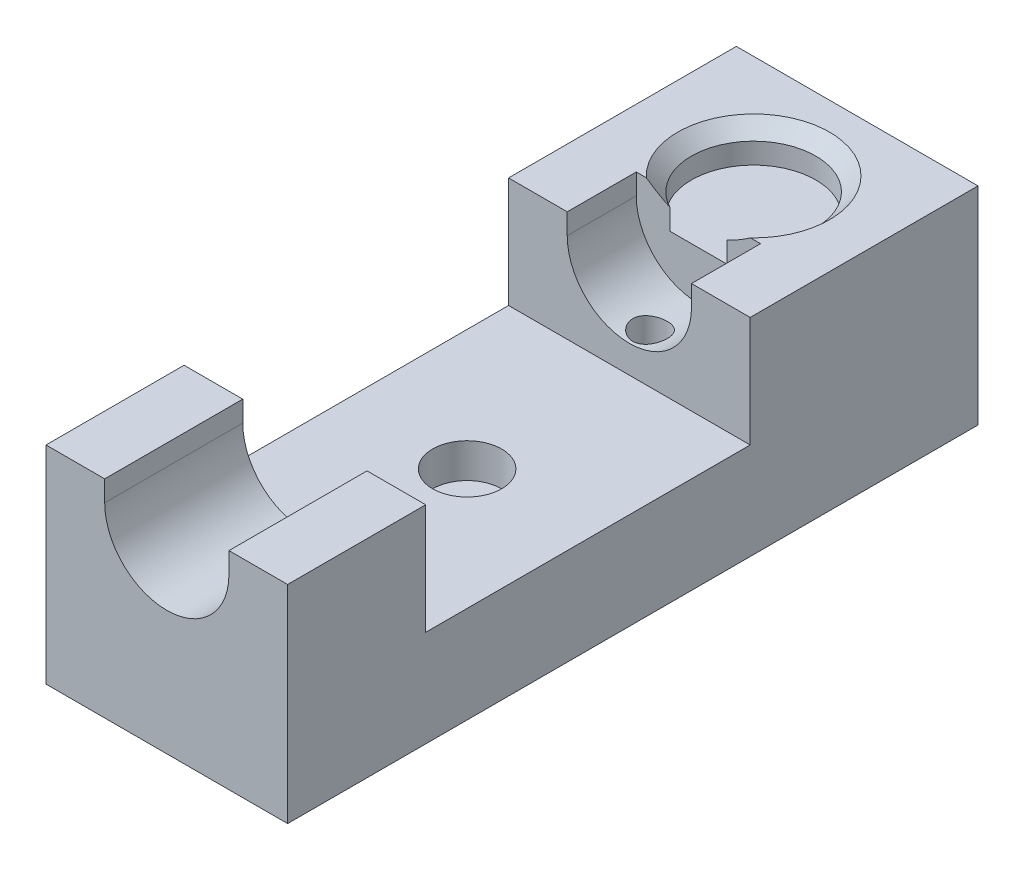
ISO-10303-21;
HEADER;
FILE_DESCRIPTION(('STEP AP214'),'2;1');
FILE_NAME('part.step','',(''),(''),'','','');
FILE_SCHEMA(('AUTOMOTIVE_DESIGN { 1 0 10303 214 1 1 1 1 }'));
ENDSEC;
DATA;
#1=APPLICATION_CONTEXT('core data for automotive mechanical design processes');
#2=APPLICATION_PROTOCOL_DEFINITION('international standard','automotive_design',2000,#1);
#3=PRODUCT_CONTEXT('',#1,'mechanical');
#4=PRODUCT('Part','Part','',(#3));
#5=PRODUCT_RELATED_PRODUCT_CATEGORY('part','',(#4));
#6=PRODUCT_DEFINITION_FORMATION('','',#4);
#7=PRODUCT_DEFINITION_CONTEXT('part definition',#1,'design');
#8=PRODUCT_DEFINITION('design','',#6,#7);
#9=PRODUCT_DEFINITION_SHAPE('','',#8);
#10=(LENGTH_UNIT() NAMED_UNIT(*) SI_UNIT(.MILLI.,.METRE.));
#11=(NAMED_UNIT(*) PLANE_ANGLE_UNIT() SI_UNIT($,.RADIAN.));
#12=(NAMED_UNIT(*) SI_UNIT($,.STERADIAN.) SOLID_ANGLE_UNIT());
#13=UNCERTAINTY_MEASURE_WITH_UNIT(LENGTH_MEASURE(1.E-05),#10,'distance_accuracy_value','');
#14=(GEOMETRIC_REPRESENTATION_CONTEXT(3) GLOBAL_UNCERTAINTY_ASSIGNED_CONTEXT((#13)) GLOBAL_UNIT_ASSIGNED_CONTEXT((#10,
#11,#12)) REPRESENTATION_CONTEXT('',''));
#15=CARTESIAN_POINT('',(0.,0.,0.));
#16=DIRECTION('',(0.,0.,1.));
#17=DIRECTION('',(1.,0.,0.));
#18=AXIS2_PLACEMENT_3D('',#15,#16,#17);
#19=CARTESIAN_POINT('',(0.,30.,0.));
#20=DIRECTION('',(0.,1.,0.));
#21=DIRECTION('',(0.,0.,1.));
#22=AXIS2_PLACEMENT_3D('',#19,#20,#21);
#23=PLANE('',#22);
#24=DIRECTION('',(-1.,0.,0.));
#25=VECTOR('',#24,1.);
#26=CARTESIAN_POINT('',(-17.5,30.,-17.));
#27=LINE('',#26,#25);
#28=CARTESIAN_POINT('',(17.5,30.,-17.));
#29=VERTEX_POINT('',#28);
#30=CARTESIAN_POINT('',(9.00000000000001,30.,-17.));
#31=VERTEX_POINT('',#30);
#32=EDGE_CURVE('E191',#29,#31,#27,.T.);
#33=ORIENTED_EDGE('',*,*,#32,.F.);
#34=DIRECTION('',(0.,0.,-1.));
#35=VECTOR('',#34,1.);
#36=CARTESIAN_POINT('',(17.5,30.,50.));
#37=LINE('',#36,#35);
#38=CARTESIAN_POINT('',(17.5,30.,-50.));
#39=VERTEX_POINT('',#38);
#40=EDGE_CURVE('E259',#29,#39,#37,.T.);
#41=ORIENTED_EDGE('',*,*,#40,.T.);
#42=DIRECTION('',(-1.,0.,0.));
#43=VECTOR('',#42,1.);
#44=CARTESIAN_POINT('',(17.5,30.,-50.));
#45=LINE('',#44,#43);
#46=CARTESIAN_POINT('',(-17.5,30.,-50.));
#47=VERTEX_POINT('',#46);
#48=EDGE_CURVE('E263',#39,#47,#45,.T.);
#49=ORIENTED_EDGE('',*,*,#48,.T.);
#50=DIRECTION('',(0.,0.,1.));
#51=VECTOR('',#50,1.);
#52=CARTESIAN_POINT('',(-17.5,30.,50.));
#53=LINE('',#52,#51);
#54=CARTESIAN_POINT('',(-17.5,30.,-17.));
#55=VERTEX_POINT('',#54);
#56=EDGE_CURVE('E252',#47,#55,#53,.T.);
#57=ORIENTED_EDGE('',*,*,#56,.T.);
#58=CARTESIAN_POINT('',(-9.,30.,-17.));
#59=VERTEX_POINT('',#58);
#60=EDGE_CURVE('E367',#59,#55,#27,.T.);
#61=ORIENTED_EDGE('',*,*,#60,.F.);
#62=DIRECTION('',(0.,0.,1.));
#63=VECTOR('',#62,1.);
#64=CARTESIAN_POINT('',(-9.,30.,0.));
#65=LINE('',#64,#63);
#66=CARTESIAN_POINT('',(-9.,30.,-27.));
#67=VERTEX_POINT('',#66);
#68=EDGE_CURVE('E428',#67,#59,#65,.T.);
#69=ORIENTED_EDGE('',*,*,#68,.F.);
#70=DIRECTION('',(1.,0.,0.));
#71=VECTOR('',#70,1.);
#72=CARTESIAN_POINT('',(0.,30.,-27.));
#73=LINE('',#72,#71);
#74=CARTESIAN_POINT('',(-7.54983443527076,30.,-27.));
#75=VERTEX_POINT('',#74);
#76=EDGE_CURVE('E243',#67,#75,#73,.T.);
#77=ORIENTED_EDGE('',*,*,#76,.T.);
#78=CARTESIAN_POINT('',(0.,30.,-35.));
#79=DIRECTION('',(0.,1.,0.));
#80=DIRECTION('',(0.,0.,1.));
#81=AXIS2_PLACEMENT_3D('',#78,#79,#80);
#82=CIRCLE('',#81,11.);
#83=CARTESIAN_POINT('',(7.54983443527076,30.,-27.));
#84=VERTEX_POINT('',#83);
#85=EDGE_CURVE('E288',#75,#84,#82,.F.);
#86=ORIENTED_EDGE('',*,*,#85,.T.);
#87=CARTESIAN_POINT('',(9.,30.,-27.));
#88=VERTEX_POINT('',#87);
#89=EDGE_CURVE('E65',#84,#88,#73,.T.);
#90=ORIENTED_EDGE('',*,*,#89,.T.);
#91=DIRECTION('',(0.,0.,-1.));
#92=VECTOR('',#91,1.);
#93=CARTESIAN_POINT('',(9.,30.,0.));
#94=LINE('',#93,#92);
#95=EDGE_CURVE('E365',#31,#88,#94,.T.);
#96=ORIENTED_EDGE('',*,*,#95,.F.);
#97=EDGE_LOOP('',(#33,#41,#49,#57,#61,#69,#77,#86,#90,#96));
#98=FACE_BOUND('',#97,.T.);
#99=ADVANCED_FACE('F36',(#98),#23,.T.);
#100=DIRECTION('',(1.,0.,0.));
#101=VECTOR('',#100,1.);
#102=CARTESIAN_POINT('',(-17.5,30.,30.));
#103=LINE('',#102,#101);
#104=CARTESIAN_POINT('',(-17.5,30.,30.));
#105=VERTEX_POINT('',#104);
#106=CARTESIAN_POINT('',(-9.,30.,30.));
#107=VERTEX_POINT('',#106);
#108=EDGE_CURVE('E57',#105,#107,#103,.T.);
#109=ORIENTED_EDGE('',*,*,#108,.F.);
#110=CARTESIAN_POINT('',(-17.5,30.,50.));
#111=VERTEX_POINT('',#110);
#112=EDGE_CURVE('E196',#105,#111,#53,.T.);
#113=ORIENTED_EDGE('',*,*,#112,.T.);
#114=DIRECTION('',(1.,0.,0.));
#115=VECTOR('',#114,1.);
#116=CARTESIAN_POINT('',(17.5,30.,50.));
#117=LINE('',#116,#115);
#118=CARTESIAN_POINT('',(-9.,30.,50.));
#119=VERTEX_POINT('',#118);
#120=EDGE_CURVE('E256',#111,#119,#117,.T.);
#121=ORIENTED_EDGE('',*,*,#120,.T.);
#122=EDGE_CURVE('E427',#107,#119,#65,.T.);
#123=ORIENTED_EDGE('',*,*,#122,.F.);
#124=EDGE_LOOP('',(#109,#113,#121,#123));
#125=FACE_BOUND('',#124,.T.);
#126=ADVANCED_FACE('F336',(#125),#23,.T.);
#127=CARTESIAN_POINT('',(9.,33.,-80.));
#128=DIRECTION('',(1.,0.,0.));
#129=DIRECTION('',(0.,0.,-1.));
#130=AXIS2_PLACEMENT_3D('',#127,#128,#129);
#131=PLANE('',#130);
#132=DIRECTION('',(0.,0.,1.));
#133=VECTOR('',#132,1.);
#134=CARTESIAN_POINT('',(9.,27.,-80.));
#135=LINE('',#134,#133);
#136=CARTESIAN_POINT('',(9.,27.,-27.));
#137=VERTEX_POINT('',#136);
#138=CARTESIAN_POINT('',(9.,27.,-17.));
#139=VERTEX_POINT('',#138);
#140=EDGE_CURVE('E220',#137,#139,#135,.T.);
#141=ORIENTED_EDGE('',*,*,#140,.T.);
#142=DIRECTION('',(0.,1.,0.));
#143=VECTOR('',#142,1.);
#144=CARTESIAN_POINT('',(9.,33.,-17.));
#145=LINE('',#144,#143);
#146=EDGE_CURVE('E213',#139,#31,#145,.T.);
#147=ORIENTED_EDGE('',*,*,#146,.T.);
#148=ORIENTED_EDGE('',*,*,#95,.T.);
#149=DIRECTION('',(0.,-1.,0.));
#150=VECTOR('',#149,1.);
#151=CARTESIAN_POINT('',(9.,33.,-27.));
#152=LINE('',#151,#150);
#153=EDGE_CURVE('E219',#88,#137,#152,.T.);
#154=ORIENTED_EDGE('',*,*,#153,.T.);
#155=EDGE_LOOP('',(#141,#147,#148,#154));
#156=FACE_BOUND('',#155,.T.);
#157=ADVANCED_FACE('F313',(#156),#131,.F.);
#158=CARTESIAN_POINT('',(0.,27.,-80.));
#159=DIRECTION('',(0.,0.,1.));
#160=DIRECTION('',(1.,0.,0.));
#161=AXIS2_PLACEMENT_3D('',#158,#159,#160);
#162=CYLINDRICAL_SURFACE('',#161,9.);
#163=CARTESIAN_POINT('',(0.,18.,-22.5));
#164=CARTESIAN_POINT('',(0.137602501766358,18.0000018396614,-22.4999972008295));
#165=CARTESIAN_POINT('',(0.275234247505333,18.0031865182634,-22.4886013603894));
#166=CARTESIAN_POINT('',(0.546518951988475,18.0155809960352,-22.4434085434694));
#167=CARTESIAN_POINT('',(0.680170207326877,18.0247933370148,-22.4096021165725));
#168=CARTESIAN_POINT('',(0.939539899360599,18.0482286921083,-22.3207825611722));
#169=CARTESIAN_POINT('',(1.06526878019133,18.0624449393814,-22.2657980626032));
#170=CARTESIAN_POINT('',(1.30572139048354,18.0943937483594,-22.1362929873462));
#171=CARTESIAN_POINT('',(1.4204441416246,18.1121266222237,-22.0617706761614));
#172=CARTESIAN_POINT('',(1.63849356943183,18.1496968436527,-21.8933411323144));
#173=CARTESIAN_POINT('',(1.7415062256169,18.1695725275357,-21.7990359206252));
#174=CARTESIAN_POINT('',(1.93047637139271,18.2089478576453,-21.5945674457565));
#175=CARTESIAN_POINT('',(2.01643146169123,18.2284474506237,-21.4844019554483));
#176=CARTESIAN_POINT('',(2.1704161716063,18.2652591141456,-21.2487854797426));
#177=CARTESIAN_POINT('',(2.23807749895612,18.282523041218,-21.1230855831171));
#178=CARTESIAN_POINT('',(2.3511791426234,18.3123419836963,-20.8615361647152));
#179=CARTESIAN_POINT('',(2.39662394672713,18.324897950001,-20.7256886991666));
#180=CARTESIAN_POINT('',(2.46289848736025,18.3434823376449,-20.4511944222944));
#181=CARTESIAN_POINT('',(2.48430073808206,18.3496622817879,-20.3126963567531));
#182=CARTESIAN_POINT('',(2.50366854155515,18.355247014148,-20.0339482289146));
#183=CARTESIAN_POINT('',(2.50163888054625,18.354653185987,-19.8936985302551));
#184=CARTESIAN_POINT('',(2.47465342675359,18.3468926634988,-19.6199554425519));
#185=CARTESIAN_POINT('',(2.45039804541373,18.3399267865017,-19.4863863970069));
#186=CARTESIAN_POINT('',(2.38077462403777,18.3205296590571,-19.2252927428175));
#187=CARTESIAN_POINT('',(2.33540476914306,18.3080979388073,-19.0977686547957));
#188=CARTESIAN_POINT('',(2.22428746268938,18.2789986044504,-18.8505955370892));
#189=CARTESIAN_POINT('',(2.15830043673984,18.2622816279868,-18.7310602663798));
#190=CARTESIAN_POINT('',(2.00798881359268,18.2265209863233,-18.5045168488176));
#191=CARTESIAN_POINT('',(1.92366033258119,18.2074768287162,-18.3975113625477));
#192=CARTESIAN_POINT('',(1.73551122056888,18.1683785574608,-18.1950722391272));
#193=CARTESIAN_POINT('',(1.63110455940471,18.1483125992435,-18.1001847302403));
#194=CARTESIAN_POINT('',(1.40761321440207,18.1100360037841,-17.9291485384444));
#195=CARTESIAN_POINT('',(1.28852785084393,18.091825452531,-17.853000723795));
#196=CARTESIAN_POINT('',(1.03816685867623,18.0591832057447,-17.7213363687399));
#197=CARTESIAN_POINT('',(0.906832791495493,18.0447710270893,-17.6659257921222));
#198=CARTESIAN_POINT('',(0.636219977539428,18.0214901499711,-17.5781318031173));
#199=CARTESIAN_POINT('',(0.49694312824226,18.012620133526,-17.5457429156869));
#200=CARTESIAN_POINT('',(0.219053215426284,18.0016252703318,-17.5057857264421));
#201=CARTESIAN_POINT('',(0.0805546117173627,17.9992989235194,-17.4974757101857));
#202=CARTESIAN_POINT('',(-0.195859861273135,18.0010703941368,-17.5038539965849));
#203=CARTESIAN_POINT('',(-0.33377579456904,18.0051674864365,-17.5185397032961));
#204=CARTESIAN_POINT('',(-0.602413826941716,18.0191946988196,-17.5698866682393));
#205=CARTESIAN_POINT('',(-0.733222576327719,18.0290132566489,-17.606127890115));
#206=CARTESIAN_POINT('',(-0.986886236237452,18.0533634166124,-17.6990637352762));
#207=CARTESIAN_POINT('',(-1.10974024794481,18.0678955502287,-17.7557606651392));
#208=CARTESIAN_POINT('',(-1.34684028081078,18.1005251943186,-17.8893317560929));
#209=CARTESIAN_POINT('',(-1.4608541239069,18.1186905731965,-17.9666010486448));
#210=CARTESIAN_POINT('',(-1.67455534117418,18.156490457428,-18.1386322716154));
#211=CARTESIAN_POINT('',(-1.77423962926342,18.1761252778671,-18.2333979601334));
#212=CARTESIAN_POINT('',(-1.9596240538892,18.2154031463424,-18.4412028877548));
#213=CARTESIAN_POINT('',(-2.04479915770501,18.2350278359544,-18.5547149031079));
#214=CARTESIAN_POINT('',(-2.1949116285828,18.2714061338011,-18.7948412757667));
#215=CARTESIAN_POINT('',(-2.25984976965913,18.2881598518323,-18.9214551317123));
#216=CARTESIAN_POINT('',(-2.36716211667702,18.3167040212995,-19.1836143397486));
#217=CARTESIAN_POINT('',(-2.4096615496651,18.3285219396518,-19.3191052754281));
#218=CARTESIAN_POINT('',(-2.47115304987672,18.3458424635326,-19.5956994187438));
#219=CARTESIAN_POINT('',(-2.49015175812551,18.3513468531573,-19.7368010292315));
#220=CARTESIAN_POINT('',(-2.50369719949209,18.3552592333494,-20.0152115590136));
#221=CARTESIAN_POINT('',(-2.49909142028598,18.353913191859,-20.152476380069));
#222=CARTESIAN_POINT('',(-2.46754286573619,18.3448572602375,-20.4241897876208));
#223=CARTESIAN_POINT('',(-2.44060076098729,18.3371475611601,-20.5586384585411));
#224=CARTESIAN_POINT('',(-2.36565448497556,18.3163856235018,-20.8197344678233));
#225=CARTESIAN_POINT('',(-2.31784429282322,18.3033826616438,-20.9464416852921));
#226=CARTESIAN_POINT('',(-2.2026690334138,18.2735016790497,-21.1901348450181));
#227=CARTESIAN_POINT('',(-2.13530066717351,18.2566230046766,-21.3071191429723));
#228=CARTESIAN_POINT('',(-1.98041392404218,18.220223784267,-21.5320553056494));
#229=CARTESIAN_POINT('',(-1.89232416869259,18.2006364203479,-21.6396029533652));
#230=CARTESIAN_POINT('',(-1.69956305490125,18.1613833618196,-21.8386647441072));
#231=CARTESIAN_POINT('',(-1.59488759125636,18.1417176489956,-21.930174905782));
#232=CARTESIAN_POINT('',(-1.36892046461578,18.1039632083671,-22.0967162731561));
#233=CARTESIAN_POINT('',(-1.24729251786435,18.0859231761437,-22.1713032466213));
#234=CARTESIAN_POINT('',(-0.992723965385674,18.0540005019884,-22.298856278579));
#235=CARTESIAN_POINT('',(-0.859790060353445,18.0401154192934,-22.351835037162));
#236=CARTESIAN_POINT('',(-0.606290967533398,18.0196785033609,-22.4284401614694));
#237=CARTESIAN_POINT('',(-0.48672880433748,18.0123550867629,-22.4552095751857));
#238=CARTESIAN_POINT('',(-0.244785251386816,18.0025153004743,-22.4909896916451));
#239=CARTESIAN_POINT('',(-0.12240419603883,17.9999983635306,-22.5000024899998));
#240=CARTESIAN_POINT('',(0.,18.,-22.5));
#241=B_SPLINE_CURVE_WITH_KNOTS('',3,(#163,#164,#165,#166,#167,#168,#169,#170,#171,#172,#173,
#174,#175,#176,#177,#178,#179,#180,#181,#182,#183,#184,#185,#186,#187,#188,#189,#190,#191,#192,
#193,#194,#195,#196,#197,#198,#199,#200,#201,#202,#203,#204,#205,#206,#207,#208,#209,#210,#211,
#212,#213,#214,#215,#216,#217,#218,#219,#220,#221,#222,#223,#224,#225,#226,#227,#228,#229,#230,
#231,#232,#233,#234,#235,#236,#237,#238,#239,#240),.UNSPECIFIED.,.T.,.F.,(4,2,2,2,2,2,2,2,2,2,2,
2,2,2,2,2,2,2,2,2,2,2,2,2,2,2,2,2,2,2,2,2,2,2,2,2,2,2,4),(0.,0.41235838619898,0.824890772294518,
1.2368674158857,1.64888064567586,2.07015248650528,2.4914835408799,2.92075380647343,
3.34993732266767,3.76866863882697,4.18731442577044,4.59320465989599,4.99912978807062,
5.40995920090066,5.82087569194105,6.24638987685078,6.67192377325046,7.09960331280653,
7.52718110708768,7.94144021185607,8.35565255505709,8.76204634963727,9.16848598334831,
9.58337897777206,9.99836119210681,10.4261198341446,10.8538621134515,11.279191297197,
11.7044002604958,12.1144519850639,12.5244913992549,12.9307978713244,13.3371729171665,
13.7564382656793,14.1758075510163,14.6051618118986,15.0342633576383,15.4011197307045,
15.7679328052826),.UNSPECIFIED.);
#242=CARTESIAN_POINT('',(0.,18.,-22.5));
#243=VERTEX_POINT('',#242);
#244=EDGE_CURVE('E41',#243,#243,#241,.T.);
#245=ORIENTED_EDGE('',*,*,#244,.T.);
#246=EDGE_LOOP('',(#245));
#247=FACE_BOUND('',#246,.T.);
#248=DIRECTION('',(0.,0.,1.));
#249=VECTOR('',#248,1.);
#250=CARTESIAN_POINT('',(-9.,27.,-80.));
#251=LINE('',#250,#249);
#252=CARTESIAN_POINT('',(-9.,27.,-27.));
#253=VERTEX_POINT('',#252);
#254=CARTESIAN_POINT('',(-9.,27.,-17.));
#255=VERTEX_POINT('',#254);
#256=EDGE_CURVE('E234',#253,#255,#251,.T.);
#257=ORIENTED_EDGE('',*,*,#256,.T.);
#258=CARTESIAN_POINT('',(0.,27.,-17.));
#259=DIRECTION('',(0.,0.,-1.));
#260=DIRECTION('',(-1.,0.,0.));
#261=AXIS2_PLACEMENT_3D('',#258,#259,#260);
#262=CIRCLE('',#261,9.);
#263=EDGE_CURVE('E210',#255,#139,#262,.F.);
#264=ORIENTED_EDGE('',*,*,#263,.T.);
#265=ORIENTED_EDGE('',*,*,#140,.F.);
#266=CARTESIAN_POINT('',(0.,27.,-27.));
#267=DIRECTION('',(0.,0.,1.));
#268=DIRECTION('',(1.,0.,0.));
#269=AXIS2_PLACEMENT_3D('',#266,#267,#268);
#270=CIRCLE('',#269,9.);
#271=EDGE_CURVE('E217',#137,#253,#270,.F.);
#272=ORIENTED_EDGE('',*,*,#271,.T.);
#273=EDGE_LOOP('',(#257,#264,#265,#272));
#274=FACE_BOUND('',#273,.T.);
#275=ADVANCED_FACE('F318',(#247,#274),#162,.F.);
#276=CARTESIAN_POINT('',(-9.,33.,-80.));
#277=DIRECTION('',(-1.,0.,0.));
#278=DIRECTION('',(0.,0.,1.));
#279=AXIS2_PLACEMENT_3D('',#276,#277,#278);
#280=PLANE('',#279);
#281=ORIENTED_EDGE('',*,*,#68,.T.);
#282=DIRECTION('',(0.,-1.,0.));
#283=VECTOR('',#282,1.);
#284=CARTESIAN_POINT('',(-9.,33.,-17.));
#285=LINE('',#284,#283);
#286=EDGE_CURVE('E12',#59,#255,#285,.T.);
#287=ORIENTED_EDGE('',*,*,#286,.T.);
#288=ORIENTED_EDGE('',*,*,#256,.F.);
#289=DIRECTION('',(0.,1.,0.));
#290=VECTOR('',#289,1.);
#291=CARTESIAN_POINT('',(-9.,33.,-27.));
#292=LINE('',#291,#290);
#293=EDGE_CURVE('E222',#253,#67,#292,.T.);
#294=ORIENTED_EDGE('',*,*,#293,.T.);
#295=EDGE_LOOP('',(#281,#287,#288,#294));
#296=FACE_BOUND('',#295,.T.);
#297=ADVANCED_FACE('F322',(#296),#280,.F.);
#298=CARTESIAN_POINT('',(0.,25.,-35.));
#299=DIRECTION('',(0.,1.,0.));
#300=DIRECTION('',(0.,0.,1.));
#301=AXIS2_PLACEMENT_3D('',#298,#299,#300);
#302=CYLINDRICAL_SURFACE('',#301,9.);
#303=DIRECTION('',(0.,1.,0.));
#304=VECTOR('',#303,1.);
#305=CARTESIAN_POINT('',(4.12310562561765,25.,-27.));
#306=LINE('',#305,#304);
#307=CARTESIAN_POINT('',(4.12310562561765,28.,-27.));
#308=VERTEX_POINT('',#307);
#309=CARTESIAN_POINT('',(4.12310562561765,25.,-27.));
#310=VERTEX_POINT('',#309);
#311=EDGE_CURVE('E239',#308,#310,#306,.F.);
#312=ORIENTED_EDGE('',*,*,#311,.F.);
#313=CARTESIAN_POINT('',(0.,28.,-35.));
#314=DIRECTION('',(0.,1.,0.));
#315=DIRECTION('',(0.,0.,1.));
#316=AXIS2_PLACEMENT_3D('',#313,#314,#315);
#317=CIRCLE('',#316,9.);
#318=CARTESIAN_POINT('',(-4.12310562561764,28.,-27.));
#319=VERTEX_POINT('',#318);
#320=EDGE_CURVE('E285',#308,#319,#317,.T.);
#321=ORIENTED_EDGE('',*,*,#320,.T.);
#322=DIRECTION('',(0.,1.,0.));
#323=VECTOR('',#322,1.);
#324=CARTESIAN_POINT('',(-4.12310562561764,25.,-27.));
#325=LINE('',#324,#323);
#326=CARTESIAN_POINT('',(-4.12310562561764,25.,-27.));
#327=VERTEX_POINT('',#326);
#328=EDGE_CURVE('E246',#327,#319,#325,.T.);
#329=ORIENTED_EDGE('',*,*,#328,.F.);
#330=CARTESIAN_POINT('',(0.,25.,-35.));
#331=DIRECTION('',(0.,1.,0.));
#332=DIRECTION('',(0.,0.,1.));
#333=AXIS2_PLACEMENT_3D('',#330,#331,#332);
#334=CIRCLE('',#333,9.);
#335=EDGE_CURVE('E248',#310,#327,#334,.T.);
#336=ORIENTED_EDGE('',*,*,#335,.F.);
#337=EDGE_LOOP('',(#312,#321,#329,#336));
#338=FACE_BOUND('',#337,.T.);
#339=ADVANCED_FACE('F326',(#338),#302,.F.);
#340=CARTESIAN_POINT('',(0.,25.,-35.));
#341=DIRECTION('',(0.,1.,0.));
#342=DIRECTION('',(0.,0.,1.));
#343=AXIS2_PLACEMENT_3D('',#340,#341,#342);
#344=PLANE('',#343);
#345=ORIENTED_EDGE('',*,*,#335,.T.);
#346=DIRECTION('',(1.,0.,0.));
#347=VECTOR('',#346,1.);
#348=CARTESIAN_POINT('',(0.,25.,-27.));
#349=LINE('',#348,#347);
#350=EDGE_CURVE('E242',#327,#310,#349,.T.);
#351=ORIENTED_EDGE('',*,*,#350,.T.);
#352=EDGE_LOOP('',(#345,#351));
#353=FACE_BOUND('',#352,.T.);
#354=ADVANCED_FACE('F323',(#353),#344,.T.);
#355=CARTESIAN_POINT('',(0.,28.,-35.));
#356=DIRECTION('',(0.,1.,0.));
#357=DIRECTION('',(0.,0.,1.));
#358=AXIS2_PLACEMENT_3D('',#355,#356,#357);
#359=CONICAL_SURFACE('',#358,9.,0.785398163397451);
#360=ORIENTED_EDGE('',*,*,#85,.F.);
#361=CARTESIAN_POINT('',(-19.8666621657649,40.4169154083549,-27.));
#362=CARTESIAN_POINT('',(-19.5670431805727,40.1389918048468,-27.));
#363=CARTESIAN_POINT('',(-19.2669938004324,39.8615313307034,-27.));
#364=CARTESIAN_POINT('',(-18.6659002527451,39.3076859468649,-27.));
#365=CARTESIAN_POINT('',(-18.3648560781792,39.031301044789,-27.));
#366=CARTESIAN_POINT('',(-17.7615772989688,38.4796998100724,-27.));
#367=CARTESIAN_POINT('',(-17.4593424486667,38.2044837458635,-27.));
#368=CARTESIAN_POINT('',(-16.8535816584682,37.6554787578372,-27.));
#369=CARTESIAN_POINT('',(-16.5500557210161,37.3816898313201,-27.));
#370=CARTESIAN_POINT('',(-15.633583861047,36.5594796740582,-27.));
#371=CARTESIAN_POINT('',(-15.0183866200404,36.01355499078,-27.));
#372=CARTESIAN_POINT('',(-14.0895560008401,35.2016415507465,-27.));
#373=CARTESIAN_POINT('',(-13.7789566666907,34.9321801351757,-27.));
#374=CARTESIAN_POINT('',(-13.1553620762469,34.3960423829714,-27.));
#375=CARTESIAN_POINT('',(-12.8423668310399,34.1293660334631,-27.));
#376=CARTESIAN_POINT('',(-12.2770405963839,33.6529013025091,-27.));
#377=CARTESIAN_POINT('',(-12.0252250435898,33.4425015897792,-27.));
#378=CARTESIAN_POINT('',(-11.5195086995499,33.024224372918,-27.));
#379=CARTESIAN_POINT('',(-11.2656079245874,32.8163468491225,-27.));
#380=CARTESIAN_POINT('',(-10.7553207061515,32.4035226903952,-27.));
#381=CARTESIAN_POINT('',(-10.4989336239268,32.1985768440045,-27.));
#382=CARTESIAN_POINT('',(-9.98334111050169,31.7922595853298,-27.));
#383=CARTESIAN_POINT('',(-9.72413570074207,31.5908881458835,-27.));
#384=CARTESIAN_POINT('',(-9.20273681591375,31.1927052829389,-27.));
#385=CARTESIAN_POINT('',(-8.94054734830518,30.9958886226879,-27.));
#386=CARTESIAN_POINT('',(-8.41227708683221,30.6075118923883,-27.));
#387=CARTESIAN_POINT('',(-8.14619613736109,30.4159520334266,-27.));
#388=CARTESIAN_POINT('',(-7.60956501272711,30.0394261514339,-27.));
#389=CARTESIAN_POINT('',(-7.33901681467567,29.8544573200634,-27.));
#390=CARTESIAN_POINT('',(-6.792531359551,29.4926889481935,-27.));
#391=CARTESIAN_POINT('',(-6.5165947236771,29.3158884738333,-27.));
#392=CARTESIAN_POINT('',(-5.96926851045465,28.9793500494816,-27.));
#393=CARTESIAN_POINT('',(-5.69812439589338,28.8192149849589,-27.));
#394=CARTESIAN_POINT('',(-5.14895094637564,28.5110473897559,-27.));
#395=CARTESIAN_POINT('',(-4.87092084914534,28.36301620684,-27.));
#396=CARTESIAN_POINT('',(-4.30722807174604,28.0825365797291,-27.));
#397=CARTESIAN_POINT('',(-4.02156962555449,27.9500797031615,-27.));
#398=CARTESIAN_POINT('',(-3.4418174135611,27.7050086864469,-27.));
#399=CARTESIAN_POINT('',(-3.14772600169208,27.5923890705363,-27.));
#400=CARTESIAN_POINT('',(-2.61604920010849,27.4140019794291,-27.));
#401=CARTESIAN_POINT('',(-2.38010467001172,27.3433723376713,-27.));
#402=CARTESIAN_POINT('',(-1.9035200546437,27.2201249008248,-27.));
#403=CARTESIAN_POINT('',(-1.66288055043966,27.1675048915583,-27.));
#404=CARTESIAN_POINT('',(-1.17878115599915,27.0828809592266,-27.));
#405=CARTESIAN_POINT('',(-0.935333393689107,27.0508086585682,-27.));
#406=CARTESIAN_POINT('',(-0.44651999810978,27.0087529416456,-27.));
#407=CARTESIAN_POINT('',(-0.201154482819247,26.9987681771404,-27.));
#408=CARTESIAN_POINT('',(0.290193231333585,27.0014795504052,-27.));
#409=CARTESIAN_POINT('',(0.536175046229777,27.0142444988249,-27.));
#410=CARTESIAN_POINT('',(1.02597796554054,27.0618346881289,-27.));
#411=CARTESIAN_POINT('',(1.2697988998105,27.0966616507684,-27.));
#412=CARTESIAN_POINT('',(1.75439764187019,27.186635431302,-27.));
#413=CARTESIAN_POINT('',(1.99516350407844,27.2418456494544,-27.));
#414=CARTESIAN_POINT('',(2.47186691237024,27.3700284389632,-27.));
#415=CARTESIAN_POINT('',(2.7078042110371,27.4430019180549,-27.));
#416=CARTESIAN_POINT('',(3.1984597169047,27.6123033680078,-27.));
#417=CARTESIAN_POINT('',(3.45261020595399,27.7102624226325,-27.));
#418=CARTESIAN_POINT('',(3.95466251121506,27.9211779347405,-27.));
#419=CARTESIAN_POINT('',(4.20256166312908,28.0341406623654,-27.));
#420=CARTESIAN_POINT('',(4.69283623573977,28.2723637458414,-27.));
#421=CARTESIAN_POINT('',(4.93520193505558,28.3976439579074,-27.));
#422=CARTESIAN_POINT('',(5.41454501750225,28.6579920057031,-27.));
#423=CARTESIAN_POINT('',(5.65152306791171,28.7930586205818,-27.));
#424=CARTESIAN_POINT('',(6.12372072991422,29.072901232722,-27.));
#425=CARTESIAN_POINT('',(6.35887999168321,29.2177785889015,-27.));
#426=CARTESIAN_POINT('',(6.82496694550957,29.5141730814552,-27.));
#427=CARTESIAN_POINT('',(7.05589454248618,29.6656903667623,-27.));
#428=CARTESIAN_POINT('',(7.51384783909042,29.9740275824977,-27.));
#429=CARTESIAN_POINT('',(7.74087708360052,30.130842263522,-27.));
#430=CARTESIAN_POINT('',(8.1917427518241,30.4489800302676,-27.));
#431=CARTESIAN_POINT('',(8.41557920977764,30.6103030675855,-27.));
#432=CARTESIAN_POINT('',(8.89424390990901,30.9614903866272,-27.));
#433=CARTESIAN_POINT('',(9.14861978054808,31.1519703726578,-27.));
#434=CARTESIAN_POINT('',(9.65424126412794,31.5370470939244,-27.));
#435=CARTESIAN_POINT('',(9.90548677933582,31.7316439571844,-27.));
#436=CARTESIAN_POINT('',(10.4053160511475,32.1242782197103,-27.));
#437=CARTESIAN_POINT('',(10.6538995106073,32.3223159967192,-27.));
#438=CARTESIAN_POINT('',(11.1487488821807,32.7212687682572,-27.));
#439=CARTESIAN_POINT('',(11.3950147612377,32.9221838037229,-27.));
#440=CARTESIAN_POINT('',(12.1312670442653,33.5289371145042,-27.));
#441=CARTESIAN_POINT('',(12.6182497594,33.9384208521475,-27.));
#442=CARTESIAN_POINT('',(13.5861360539167,34.7645079307232,-27.));
#443=CARTESIAN_POINT('',(14.0670394624946,35.1811114709236,-27.));
#444=CARTESIAN_POINT('',(14.9958931231605,35.9949922736025,-27.));
#445=CARTESIAN_POINT('',(15.4441144296445,36.3919606466664,-27.));
#446=CARTESIAN_POINT('',(16.3372033379023,37.1896660592251,-27.));
#447=CARTESIAN_POINT('',(16.7820708692518,37.590403177463,-27.));
#448=CARTESIAN_POINT('',(17.6681756708102,38.394060579238,-27.));
#449=CARTESIAN_POINT('',(18.1094184912181,38.796974750181,-27.));
#450=CARTESIAN_POINT('',(18.9896278108283,39.6052434618337,-27.));
#451=CARTESIAN_POINT('',(19.4285944109869,40.0105978925581,-27.));
#452=CARTESIAN_POINT('',(19.8666621657649,40.416915408355,-27.));
#453=B_SPLINE_CURVE_WITH_KNOTS('',3,(#361,#362,#363,#364,#365,#366,#367,#368,#369,#370,#371,
#372,#373,#374,#375,#376,#377,#378,#379,#380,#381,#382,#383,#384,#385,#386,#387,#388,#389,#390,
#391,#392,#393,#394,#395,#396,#397,#398,#399,#400,#401,#402,#403,#404,#405,#406,#407,#408,#409,
#410,#411,#412,#413,#414,#415,#416,#417,#418,#419,#420,#421,#422,#423,#424,#425,#426,#427,#428,
#429,#430,#431,#432,#433,#434,#435,#436,#437,#438,#439,#440,#441,#442,#443,#444,#445,#446,#447,
#448,#449,#450,#451,#452),.UNSPECIFIED.,.F.,.F.,(4,2,2,2,2,2,2,2,2,2,2,2,2,2,2,2,2,2,2,2,2,2,2,
2,2,2,2,2,2,2,2,2,2,2,2,2,2,2,2,2,2,2,2,2,2,4),(0.,1.22601725628922,2.45204318151986,
3.67833690205008,4.90462830192381,7.37203693962777,8.60561016410531,9.83917768351192,
10.8235991021969,11.8080128409482,12.7926865614829,13.7773527962182,14.760824208823,
15.7443350551098,16.7274217051952,17.7103956827294,18.6548547926038,19.5994189249653,
20.5434692652414,21.4872586055109,22.225528807182,22.9637082102662,23.69941820102,
24.4350832822055,25.1729772942272,25.9109288997821,26.6511954447139,27.3914998265768,
28.2080330372563,29.0249085629936,29.8431232118293,30.661235963767,31.4897172155327,
32.3182170595747,33.1459186962834,33.9736114498771,34.9269257289532,35.8802696972673,
36.8337189931753,37.7871818679344,39.6958607988876,41.6045932374327,43.4007781310891,
45.1970006374208,46.9895629769017,48.7820451195556),.UNSPECIFIED.);
#454=EDGE_CURVE('E297',#75,#319,#453,.T.);
#455=ORIENTED_EDGE('',*,*,#454,.T.);
#456=ORIENTED_EDGE('',*,*,#320,.F.);
#457=EDGE_CURVE('E291',#308,#84,#453,.T.);
#458=ORIENTED_EDGE('',*,*,#457,.T.);
#459=EDGE_LOOP('',(#360,#455,#456,#458));
#460=FACE_BOUND('',#459,.T.);
#461=ADVANCED_FACE('F38',(#460),#359,.F.);
#462=CARTESIAN_POINT('',(-17.5,30.,50.));
#463=DIRECTION('',(1.,0.,0.));
#464=DIRECTION('',(0.,0.,-1.));
#465=AXIS2_PLACEMENT_3D('',#462,#463,#464);
#466=PLANE('',#465);
#467=DIRECTION('',(0.,0.,1.));
#468=VECTOR('',#467,1.);
#469=CARTESIAN_POINT('',(-17.5,14.,-17.));
#470=LINE('',#469,#468);
#471=CARTESIAN_POINT('',(-17.5,14.,-17.));
#472=VERTEX_POINT('',#471);
#473=CARTESIAN_POINT('',(-17.5,14.,30.));
#474=VERTEX_POINT('',#473);
#475=EDGE_CURVE('E182',#472,#474,#470,.T.);
#476=ORIENTED_EDGE('',*,*,#475,.F.);
#477=DIRECTION('',(0.,1.,0.));
#478=VECTOR('',#477,1.);
#479=CARTESIAN_POINT('',(-17.5,14.,-17.));
#480=LINE('',#479,#478);
#481=EDGE_CURVE('E207',#472,#55,#480,.T.);
#482=ORIENTED_EDGE('',*,*,#481,.T.);
#483=ORIENTED_EDGE('',*,*,#56,.F.);
#484=DIRECTION('',(0.,-1.,0.));
#485=VECTOR('',#484,1.);
#486=CARTESIAN_POINT('',(-17.5,30.,-50.));
#487=LINE('',#486,#485);
#488=CARTESIAN_POINT('',(-17.5,0.,-50.));
#489=VERTEX_POINT('',#488);
#490=EDGE_CURVE('E265',#47,#489,#487,.T.);
#491=ORIENTED_EDGE('',*,*,#490,.T.);
#492=DIRECTION('',(0.,0.,1.));
#493=VECTOR('',#492,1.);
#494=CARTESIAN_POINT('',(-17.5,0.,50.));
#495=LINE('',#494,#493);
#496=CARTESIAN_POINT('',(-17.5,0.,50.));
#497=VERTEX_POINT('',#496);
#498=EDGE_CURVE('E251',#489,#497,#495,.T.);
#499=ORIENTED_EDGE('',*,*,#498,.T.);
#500=DIRECTION('',(0.,-1.,0.));
#501=VECTOR('',#500,1.);
#502=CARTESIAN_POINT('',(-17.5,30.,50.));
#503=LINE('',#502,#501);
#504=EDGE_CURVE('E282',#111,#497,#503,.T.);
#505=ORIENTED_EDGE('',*,*,#504,.F.);
#506=ORIENTED_EDGE('',*,*,#112,.F.);
#507=DIRECTION('',(0.,1.,0.));
#508=VECTOR('',#507,1.);
#509=CARTESIAN_POINT('',(-17.5,14.,30.));
#510=LINE('',#509,#508);
#511=EDGE_CURVE('E176',#474,#105,#510,.T.);
#512=ORIENTED_EDGE('',*,*,#511,.F.);
#513=EDGE_LOOP('',(#476,#482,#483,#491,#499,#505,#506,#512));
#514=FACE_BOUND('',#513,.T.);
#515=ADVANCED_FACE('F194',(#514),#466,.F.);
#516=CARTESIAN_POINT('',(17.5,30.,50.));
#517=DIRECTION('',(0.,0.,-1.));
#518=DIRECTION('',(-1.,0.,0.));
#519=AXIS2_PLACEMENT_3D('',#516,#517,#518);
#520=PLANE('',#519);
#521=CARTESIAN_POINT('',(9.,30.,50.));
#522=VERTEX_POINT('',#521);
#523=CARTESIAN_POINT('',(17.5,30.,50.));
#524=VERTEX_POINT('',#523);
#525=EDGE_CURVE('E255',#522,#524,#117,.T.);
#526=ORIENTED_EDGE('',*,*,#525,.F.);
#527=DIRECTION('',(0.,1.,0.));
#528=VECTOR('',#527,1.);
#529=CARTESIAN_POINT('',(9.,33.,50.));
#530=LINE('',#529,#528);
#531=CARTESIAN_POINT('',(9.,27.,50.));
#532=VERTEX_POINT('',#531);
#533=EDGE_CURVE('E228',#532,#522,#530,.T.);
#534=ORIENTED_EDGE('',*,*,#533,.F.);
#535=CARTESIAN_POINT('',(0.,27.,50.));
#536=DIRECTION('',(0.,0.,1.));
#537=DIRECTION('',(1.,0.,0.));
#538=AXIS2_PLACEMENT_3D('',#535,#536,#537);
#539=CIRCLE('',#538,9.);
#540=CARTESIAN_POINT('',(-9.,27.,50.));
#541=VERTEX_POINT('',#540);
#542=EDGE_CURVE('E225',#541,#532,#539,.T.);
#543=ORIENTED_EDGE('',*,*,#542,.F.);
#544=DIRECTION('',(0.,-1.,0.));
#545=VECTOR('',#544,1.);
#546=CARTESIAN_POINT('',(-9.,33.,50.));
#547=LINE('',#546,#545);
#548=EDGE_CURVE('E216',#119,#541,#547,.T.);
#549=ORIENTED_EDGE('',*,*,#548,.F.);
#550=ORIENTED_EDGE('',*,*,#120,.F.);
#551=ORIENTED_EDGE('',*,*,#504,.T.);
#552=DIRECTION('',(1.,0.,0.));
#553=VECTOR('',#552,1.);
#554=CARTESIAN_POINT('',(17.5,0.,50.));
#555=LINE('',#554,#553);
#556=CARTESIAN_POINT('',(17.5,0.,50.));
#557=VERTEX_POINT('',#556);
#558=EDGE_CURVE('E268',#497,#557,#555,.T.);
#559=ORIENTED_EDGE('',*,*,#558,.T.);
#560=DIRECTION('',(0.,-1.,0.));
#561=VECTOR('',#560,1.);
#562=CARTESIAN_POINT('',(17.5,30.,50.));
#563=LINE('',#562,#561);
#564=EDGE_CURVE('E279',#524,#557,#563,.T.);
#565=ORIENTED_EDGE('',*,*,#564,.F.);
#566=EDGE_LOOP('',(#526,#534,#543,#549,#550,#551,#559,#565));
#567=FACE_BOUND('',#566,.T.);
#568=ADVANCED_FACE('F346',(#567),#520,.F.);
#569=CARTESIAN_POINT('',(17.5,30.,50.));
#570=DIRECTION('',(-1.,0.,0.));
#571=DIRECTION('',(0.,0.,1.));
#572=AXIS2_PLACEMENT_3D('',#569,#570,#571);
#573=PLANE('',#572);
#574=ORIENTED_EDGE('',*,*,#40,.F.);
#575=DIRECTION('',(0.,1.,0.));
#576=VECTOR('',#575,1.);
#577=CARTESIAN_POINT('',(17.5,14.,-17.));
#578=LINE('',#577,#576);
#579=CARTESIAN_POINT('',(17.5,14.,-17.));
#580=VERTEX_POINT('',#579);
#581=EDGE_CURVE('E198',#580,#29,#578,.T.);
#582=ORIENTED_EDGE('',*,*,#581,.F.);
#583=DIRECTION('',(0.,0.,-1.));
#584=VECTOR('',#583,1.);
#585=CARTESIAN_POINT('',(17.5,14.,-17.));
#586=LINE('',#585,#584);
#587=CARTESIAN_POINT('',(17.5,14.,30.));
#588=VERTEX_POINT('',#587);
#589=EDGE_CURVE('E181',#588,#580,#586,.T.);
#590=ORIENTED_EDGE('',*,*,#589,.F.);
#591=DIRECTION('',(0.,1.,0.));
#592=VECTOR('',#591,1.);
#593=CARTESIAN_POINT('',(17.5,14.,30.));
#594=LINE('',#593,#592);
#595=CARTESIAN_POINT('',(17.5,30.,30.));
#596=VERTEX_POINT('',#595);
#597=EDGE_CURVE('E178',#588,#596,#594,.T.);
#598=ORIENTED_EDGE('',*,*,#597,.T.);
#599=EDGE_CURVE('E260',#524,#596,#37,.T.);
#600=ORIENTED_EDGE('',*,*,#599,.F.);
#601=ORIENTED_EDGE('',*,*,#564,.T.);
#602=DIRECTION('',(0.,0.,-1.));
#603=VECTOR('',#602,1.);
#604=CARTESIAN_POINT('',(17.5,0.,50.));
#605=LINE('',#604,#603);
#606=CARTESIAN_POINT('',(17.5,0.,-50.));
#607=VERTEX_POINT('',#606);
#608=EDGE_CURVE('E270',#557,#607,#605,.T.);
#609=ORIENTED_EDGE('',*,*,#608,.T.);
#610=DIRECTION('',(0.,-1.,0.));
#611=VECTOR('',#610,1.);
#612=CARTESIAN_POINT('',(17.5,30.,-50.));
#613=LINE('',#612,#611);
#614=EDGE_CURVE('E276',#39,#607,#613,.T.);
#615=ORIENTED_EDGE('',*,*,#614,.F.);
#616=EDGE_LOOP('',(#574,#582,#590,#598,#600,#601,#609,#615));
#617=FACE_BOUND('',#616,.T.);
#618=ADVANCED_FACE('F342',(#617),#573,.F.);
#619=CARTESIAN_POINT('',(17.5,30.,-50.));
#620=DIRECTION('',(0.,0.,1.));
#621=DIRECTION('',(1.,0.,0.));
#622=AXIS2_PLACEMENT_3D('',#619,#620,#621);
#623=PLANE('',#622);
#624=DIRECTION('',(-1.,0.,0.));
#625=VECTOR('',#624,1.);
#626=CARTESIAN_POINT('',(17.5,0.,-50.));
#627=LINE('',#626,#625);
#628=EDGE_CURVE('E272',#607,#489,#627,.T.);
#629=ORIENTED_EDGE('',*,*,#628,.T.);
#630=ORIENTED_EDGE('',*,*,#490,.F.);
#631=ORIENTED_EDGE('',*,*,#48,.F.);
#632=ORIENTED_EDGE('',*,*,#614,.T.);
#633=EDGE_LOOP('',(#629,#630,#631,#632));
#634=FACE_BOUND('',#633,.T.);
#635=ADVANCED_FACE('F334',(#634),#623,.F.);
#636=CARTESIAN_POINT('',(9.00000000000001,30.,30.));
#637=VERTEX_POINT('',#636);
#638=EDGE_CURVE('E381',#637,#596,#103,.T.);
#639=ORIENTED_EDGE('',*,*,#638,.F.);
#640=EDGE_CURVE('E298',#522,#637,#94,.T.);
#641=ORIENTED_EDGE('',*,*,#640,.F.);
#642=ORIENTED_EDGE('',*,*,#525,.T.);
#643=ORIENTED_EDGE('',*,*,#599,.T.);
#644=EDGE_LOOP('',(#639,#641,#642,#643));
#645=FACE_BOUND('',#644,.T.);
#646=ADVANCED_FACE('F331',(#645),#23,.T.);
#647=CARTESIAN_POINT('',(0.,0.,0.));
#648=DIRECTION('',(0.,1.,0.));
#649=DIRECTION('',(0.,0.,1.));
#650=AXIS2_PLACEMENT_3D('',#647,#648,#649);
#651=PLANE('',#650);
#652=CARTESIAN_POINT('',(0.,0.,-20.));
#653=DIRECTION('',(0.,-1.,0.));
#654=DIRECTION('',(0.,0.,-1.));
#655=AXIS2_PLACEMENT_3D('',#652,#653,#654);
#656=CIRCLE('',#655,2.49999999999999);
#657=CARTESIAN_POINT('',(0.,0.,-22.5));
#658=VERTEX_POINT('',#657);
#659=EDGE_CURVE('E390',#658,#658,#656,.T.);
#660=ORIENTED_EDGE('',*,*,#659,.F.);
#661=EDGE_LOOP('',(#660));
#662=FACE_BOUND('',#661,.T.);
#663=CARTESIAN_POINT('',(0.,0.,20.));
#664=DIRECTION('',(0.,-1.,0.));
#665=DIRECTION('',(0.,0.,-1.));
#666=AXIS2_PLACEMENT_3D('',#663,#664,#665);
#667=CIRCLE('',#666,2.49999999999999);
#668=CARTESIAN_POINT('',(0.,0.,17.5));
#669=VERTEX_POINT('',#668);
#670=EDGE_CURVE('E387',#669,#669,#667,.T.);
#671=ORIENTED_EDGE('',*,*,#670,.F.);
#672=EDGE_LOOP('',(#671));
#673=FACE_BOUND('',#672,.T.);
#674=ORIENTED_EDGE('',*,*,#498,.F.);
#675=ORIENTED_EDGE('',*,*,#628,.F.);
#676=ORIENTED_EDGE('',*,*,#608,.F.);
#677=ORIENTED_EDGE('',*,*,#558,.F.);
#678=EDGE_LOOP('',(#674,#675,#676,#677));
#679=FACE_BOUND('',#678,.T.);
#680=ADVANCED_FACE('F311',(#662,#673,#679),#651,.F.);
#681=ORIENTED_EDGE('',*,*,#640,.T.);
#682=DIRECTION('',(0.,-1.,0.));
#683=VECTOR('',#682,1.);
#684=CARTESIAN_POINT('',(9.,33.,30.));
#685=LINE('',#684,#683);
#686=CARTESIAN_POINT('',(9.,27.,30.));
#687=VERTEX_POINT('',#686);
#688=EDGE_CURVE('E206',#637,#687,#685,.T.);
#689=ORIENTED_EDGE('',*,*,#688,.T.);
#690=EDGE_CURVE('E233',#687,#532,#135,.T.);
#691=ORIENTED_EDGE('',*,*,#690,.T.);
#692=ORIENTED_EDGE('',*,*,#533,.T.);
#693=EDGE_LOOP('',(#681,#689,#691,#692));
#694=FACE_BOUND('',#693,.T.);
#695=ADVANCED_FACE('F308',(#694),#131,.F.);
#696=ORIENTED_EDGE('',*,*,#690,.F.);
#697=CARTESIAN_POINT('',(0.,27.,30.));
#698=DIRECTION('',(0.,0.,1.));
#699=DIRECTION('',(1.,0.,0.));
#700=AXIS2_PLACEMENT_3D('',#697,#698,#699);
#701=CIRCLE('',#700,9.);
#702=CARTESIAN_POINT('',(-9.,27.,30.));
#703=VERTEX_POINT('',#702);
#704=EDGE_CURVE('E203',#687,#703,#701,.F.);
#705=ORIENTED_EDGE('',*,*,#704,.T.);
#706=EDGE_CURVE('E230',#703,#541,#251,.T.);
#707=ORIENTED_EDGE('',*,*,#706,.T.);
#708=ORIENTED_EDGE('',*,*,#542,.T.);
#709=EDGE_LOOP('',(#696,#705,#707,#708));
#710=FACE_BOUND('',#709,.T.);
#711=ADVANCED_FACE('F310',(#710),#162,.F.);
#712=ORIENTED_EDGE('',*,*,#706,.F.);
#713=DIRECTION('',(0.,1.,0.));
#714=VECTOR('',#713,1.);
#715=CARTESIAN_POINT('',(-9.,33.,30.));
#716=LINE('',#715,#714);
#717=EDGE_CURVE('E50',#703,#107,#716,.T.);
#718=ORIENTED_EDGE('',*,*,#717,.T.);
#719=ORIENTED_EDGE('',*,*,#122,.T.);
#720=ORIENTED_EDGE('',*,*,#548,.T.);
#721=EDGE_LOOP('',(#712,#718,#719,#720));
#722=FACE_BOUND('',#721,.T.);
#723=ADVANCED_FACE('F306',(#722),#280,.F.);
#724=CARTESIAN_POINT('',(17.5,30.,-27.));
#725=DIRECTION('',(0.,0.,1.));
#726=DIRECTION('',(1.,0.,0.));
#727=AXIS2_PLACEMENT_3D('',#724,#725,#726);
#728=PLANE('',#727);
#729=ORIENTED_EDGE('',*,*,#293,.F.);
#730=ORIENTED_EDGE('',*,*,#271,.F.);
#731=ORIENTED_EDGE('',*,*,#153,.F.);
#732=ORIENTED_EDGE('',*,*,#89,.F.);
#733=ORIENTED_EDGE('',*,*,#457,.F.);
#734=ORIENTED_EDGE('',*,*,#311,.T.);
#735=ORIENTED_EDGE('',*,*,#350,.F.);
#736=ORIENTED_EDGE('',*,*,#328,.T.);
#737=ORIENTED_EDGE('',*,*,#454,.F.);
#738=ORIENTED_EDGE('',*,*,#76,.F.);
#739=EDGE_LOOP('',(#729,#730,#731,#732,#733,#734,#735,#736,#737,#738));
#740=FACE_BOUND('',#739,.T.);
#741=ADVANCED_FACE('F300',(#740),#728,.T.);
#742=CARTESIAN_POINT('',(-17.5,14.,-17.));
#743=DIRECTION('',(0.,0.,-1.));
#744=DIRECTION('',(-1.,0.,0.));
#745=AXIS2_PLACEMENT_3D('',#742,#743,#744);
#746=PLANE('',#745);
#747=ORIENTED_EDGE('',*,*,#263,.F.);
#748=ORIENTED_EDGE('',*,*,#286,.F.);
#749=ORIENTED_EDGE('',*,*,#60,.T.);
#750=ORIENTED_EDGE('',*,*,#481,.F.);
#751=DIRECTION('',(-1.,0.,0.));
#752=VECTOR('',#751,1.);
#753=CARTESIAN_POINT('',(-17.5,14.,-17.));
#754=LINE('',#753,#752);
#755=EDGE_CURVE('E188',#580,#472,#754,.T.);
#756=ORIENTED_EDGE('',*,*,#755,.F.);
#757=ORIENTED_EDGE('',*,*,#581,.T.);
#758=ORIENTED_EDGE('',*,*,#32,.T.);
#759=ORIENTED_EDGE('',*,*,#146,.F.);
#760=EDGE_LOOP('',(#747,#748,#749,#750,#756,#757,#758,#759));
#761=FACE_BOUND('',#760,.T.);
#762=ADVANCED_FACE('F305',(#761),#746,.F.);
#763=CARTESIAN_POINT('',(-17.5,14.,30.));
#764=DIRECTION('',(0.,0.,1.));
#765=DIRECTION('',(1.,0.,0.));
#766=AXIS2_PLACEMENT_3D('',#763,#764,#765);
#767=PLANE('',#766);
#768=ORIENTED_EDGE('',*,*,#638,.T.);
#769=ORIENTED_EDGE('',*,*,#597,.F.);
#770=DIRECTION('',(1.,0.,0.));
#771=VECTOR('',#770,1.);
#772=CARTESIAN_POINT('',(-17.5,14.,30.));
#773=LINE('',#772,#771);
#774=EDGE_CURVE('E172',#474,#588,#773,.T.);
#775=ORIENTED_EDGE('',*,*,#774,.F.);
#776=ORIENTED_EDGE('',*,*,#511,.T.);
#777=ORIENTED_EDGE('',*,*,#108,.T.);
#778=ORIENTED_EDGE('',*,*,#717,.F.);
#779=ORIENTED_EDGE('',*,*,#704,.F.);
#780=ORIENTED_EDGE('',*,*,#688,.F.);
#781=EDGE_LOOP('',(#768,#769,#775,#776,#777,#778,#779,#780));
#782=FACE_BOUND('',#781,.T.);
#783=ADVANCED_FACE('F174',(#782),#767,.F.);
#784=CARTESIAN_POINT('',(0.,14.,0.));
#785=DIRECTION('',(0.,1.,0.));
#786=DIRECTION('',(0.,0.,1.));
#787=AXIS2_PLACEMENT_3D('',#784,#785,#786);
#788=PLANE('',#787);
#789=CARTESIAN_POINT('',(0.,14.,6.49999999999999));
#790=DIRECTION('',(0.,1.,0.));
#791=DIRECTION('',(0.,0.,1.));
#792=AXIS2_PLACEMENT_3D('',#789,#790,#791);
#793=CIRCLE('',#792,5.);
#794=CARTESIAN_POINT('',(0.,14.,11.5));
#795=VERTEX_POINT('',#794);
#796=EDGE_CURVE('E394',#795,#795,#793,.T.);
#797=ORIENTED_EDGE('',*,*,#796,.F.);
#798=EDGE_LOOP('',(#797));
#799=FACE_BOUND('',#798,.T.);
#800=CARTESIAN_POINT('',(0.,14.,20.));
#801=DIRECTION('',(0.,1.,0.));
#802=DIRECTION('',(0.,0.,1.));
#803=AXIS2_PLACEMENT_3D('',#800,#801,#802);
#804=CIRCLE('',#803,2.49999999999999);
#805=CARTESIAN_POINT('',(0.,14.,22.5));
#806=VERTEX_POINT('',#805);
#807=EDGE_CURVE('E384',#806,#806,#804,.T.);
#808=ORIENTED_EDGE('',*,*,#807,.F.);
#809=EDGE_LOOP('',(#808));
#810=FACE_BOUND('',#809,.T.);
#811=ORIENTED_EDGE('',*,*,#475,.T.);
#812=ORIENTED_EDGE('',*,*,#774,.T.);
#813=ORIENTED_EDGE('',*,*,#589,.T.);
#814=ORIENTED_EDGE('',*,*,#755,.T.);
#815=EDGE_LOOP('',(#811,#812,#813,#814));
#816=FACE_BOUND('',#815,.T.);
#817=ADVANCED_FACE('F186',(#799,#810,#816),#788,.T.);
#818=CARTESIAN_POINT('',(0.,0.,20.));
#819=DIRECTION('',(0.,-1.,0.));
#820=DIRECTION('',(0.,0.,-1.));
#821=AXIS2_PLACEMENT_3D('',#818,#819,#820);
#822=CYLINDRICAL_SURFACE('',#821,2.49999999999999);
#823=ORIENTED_EDGE('',*,*,#807,.T.);
#824=EDGE_LOOP('',(#823));
#825=FACE_BOUND('',#824,.T.);
#826=ORIENTED_EDGE('',*,*,#670,.T.);
#827=EDGE_LOOP('',(#826));
#828=FACE_BOUND('',#827,.T.);
#829=ADVANCED_FACE('F411',(#825,#828),#822,.F.);
#830=CARTESIAN_POINT('',(0.,0.,-20.));
#831=DIRECTION('',(0.,-1.,0.));
#832=DIRECTION('',(0.,0.,-1.));
#833=AXIS2_PLACEMENT_3D('',#830,#831,#832);
#834=CYLINDRICAL_SURFACE('',#833,2.49999999999999);
#835=ORIENTED_EDGE('',*,*,#659,.T.);
#836=EDGE_LOOP('',(#835));
#837=FACE_BOUND('',#836,.T.);
#838=ORIENTED_EDGE('',*,*,#244,.F.);
#839=EDGE_LOOP('',(#838));
#840=FACE_BOUND('',#839,.T.);
#841=ADVANCED_FACE('F405',(#837,#840),#834,.F.);
#842=CARTESIAN_POINT('',(0.,9.,6.49999999999999));
#843=DIRECTION('',(0.,1.,0.));
#844=DIRECTION('',(0.,0.,1.));
#845=AXIS2_PLACEMENT_3D('',#842,#843,#844);
#846=CYLINDRICAL_SURFACE('',#845,5.);
#847=CARTESIAN_POINT('',(0.,9.,6.49999999999999));
#848=DIRECTION('',(0.,1.,0.));
#849=DIRECTION('',(0.,0.,1.));
#850=AXIS2_PLACEMENT_3D('',#847,#848,#849);
#851=CIRCLE('',#850,5.);
#852=CARTESIAN_POINT('',(0.,9.,11.5));
#853=VERTEX_POINT('',#852);
#854=EDGE_CURVE('E393',#853,#853,#851,.T.);
#855=ORIENTED_EDGE('',*,*,#854,.F.);
#856=EDGE_LOOP('',(#855));
#857=FACE_BOUND('',#856,.T.);
#858=ORIENTED_EDGE('',*,*,#796,.T.);
#859=EDGE_LOOP('',(#858));
#860=FACE_BOUND('',#859,.T.);
#861=ADVANCED_FACE('F402',(#857,#860),#846,.F.);
#862=CARTESIAN_POINT('',(0.,9.,6.49999999999999));
#863=DIRECTION('',(0.,1.,0.));
#864=DIRECTION('',(0.,0.,1.));
#865=AXIS2_PLACEMENT_3D('',#862,#863,#864);
#866=PLANE('',#865);
#867=ORIENTED_EDGE('',*,*,#854,.T.);
#868=EDGE_LOOP('',(#867));
#869=FACE_BOUND('',#868,.T.);
#870=ADVANCED_FACE('F400',(#869),#866,.T.);
#871=CLOSED_SHELL('',(#99,#126,#157,#275,#297,#339,#354,#461,#515,#568,#618,#635,#646,#680,#695,
#711,#723,#741,#762,#783,#817,#829,#841,#861,#870));
#872=MANIFOLD_SOLID_BREP('B2',#871);
#873=ADVANCED_BREP_SHAPE_REPRESENTATION('',(#18,#872),#14);
#874=SHAPE_DEFINITION_REPRESENTATION(#9,#873);
ENDSEC;
END-ISO-10303-21;
